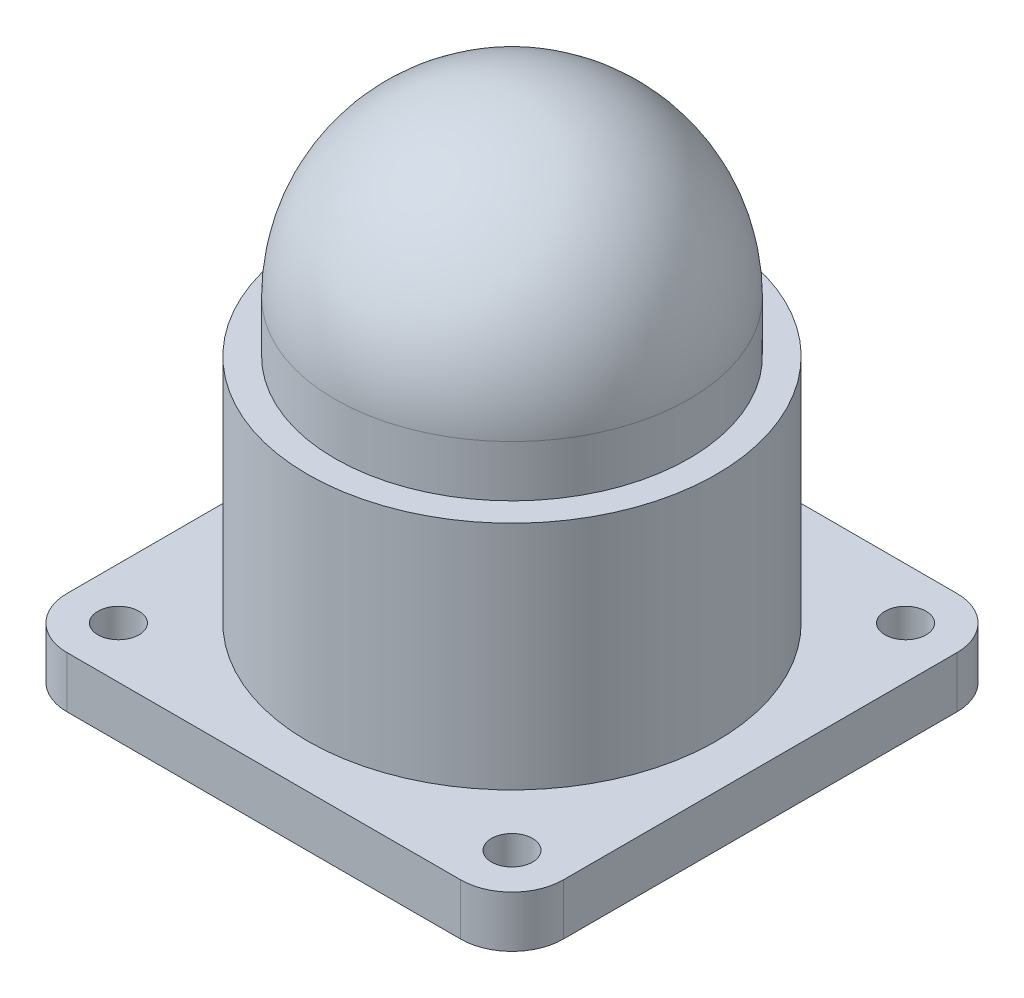
ISO-10303-21;
HEADER;
FILE_DESCRIPTION(('STEP AP214'),'2;1');
FILE_NAME('part.step','',(''),(''),'','','');
FILE_SCHEMA(('AUTOMOTIVE_DESIGN { 1 0 10303 214 1 1 1 1 }'));
ENDSEC;
DATA;
#1=APPLICATION_CONTEXT('core data for automotive mechanical design processes');
#2=APPLICATION_PROTOCOL_DEFINITION('international standard','automotive_design',2000,#1);
#3=PRODUCT_CONTEXT('',#1,'mechanical');
#4=PRODUCT('Part','Part','',(#3));
#5=PRODUCT_RELATED_PRODUCT_CATEGORY('part','',(#4));
#6=PRODUCT_DEFINITION_FORMATION('','',#4);
#7=PRODUCT_DEFINITION_CONTEXT('part definition',#1,'design');
#8=PRODUCT_DEFINITION('design','',#6,#7);
#9=PRODUCT_DEFINITION_SHAPE('','',#8);
#10=(LENGTH_UNIT() NAMED_UNIT(*) SI_UNIT(.MILLI.,.METRE.));
#11=(NAMED_UNIT(*) PLANE_ANGLE_UNIT() SI_UNIT($,.RADIAN.));
#12=(NAMED_UNIT(*) SI_UNIT($,.STERADIAN.) SOLID_ANGLE_UNIT());
#13=UNCERTAINTY_MEASURE_WITH_UNIT(LENGTH_MEASURE(1.E-05),#10,'distance_accuracy_value','');
#14=(GEOMETRIC_REPRESENTATION_CONTEXT(3) GLOBAL_UNCERTAINTY_ASSIGNED_CONTEXT((#13)) GLOBAL_UNIT_ASSIGNED_CONTEXT((#10,
#11,#12)) REPRESENTATION_CONTEXT('',''));
#15=CARTESIAN_POINT('',(0.,0.,0.));
#16=DIRECTION('',(0.,0.,1.));
#17=DIRECTION('',(1.,0.,0.));
#18=AXIS2_PLACEMENT_3D('',#15,#16,#17);
#19=CARTESIAN_POINT('',(0.,3.,0.));
#20=DIRECTION('',(0.,-1.,0.));
#21=DIRECTION('',(0.,0.,-1.));
#22=AXIS2_PLACEMENT_3D('',#19,#20,#21);
#23=PLANE('',#22);
#24=CARTESIAN_POINT('',(14.5,3.,-14.5));
#25=DIRECTION('',(0.,1.,0.));
#26=DIRECTION('',(0.,0.,1.));
#27=AXIS2_PLACEMENT_3D('',#24,#25,#26);
#28=CIRCLE('',#27,11.95);
#29=CARTESIAN_POINT('',(14.5,3.,-2.55000000000001));
#30=VERTEX_POINT('',#29);
#31=EDGE_CURVE('E44',#30,#30,#28,.T.);
#32=ORIENTED_EDGE('',*,*,#31,.F.);
#33=EDGE_LOOP('',(#32));
#34=FACE_BOUND('',#33,.T.);
#35=DIRECTION('',(-1.,0.,0.));
#36=VECTOR('',#35,1.);
#37=CARTESIAN_POINT('',(0.,3.,-29.));
#38=LINE('',#37,#36);
#39=CARTESIAN_POINT('',(26.,3.,-29.));
#40=VERTEX_POINT('',#39);
#41=CARTESIAN_POINT('',(3.,3.,-29.));
#42=VERTEX_POINT('',#41);
#43=EDGE_CURVE('E141',#40,#42,#38,.T.);
#44=ORIENTED_EDGE('',*,*,#43,.T.);
#45=CARTESIAN_POINT('',(3.,3.,-26.));
#46=DIRECTION('',(0.,-1.,0.));
#47=DIRECTION('',(0.,0.,-1.));
#48=AXIS2_PLACEMENT_3D('',#45,#46,#47);
#49=CIRCLE('',#48,3.);
#50=CARTESIAN_POINT('',(0.,3.,-26.));
#51=VERTEX_POINT('',#50);
#52=EDGE_CURVE('E160',#42,#51,#49,.F.);
#53=ORIENTED_EDGE('',*,*,#52,.T.);
#54=DIRECTION('',(0.,0.,1.));
#55=VECTOR('',#54,1.);
#56=CARTESIAN_POINT('',(0.,3.,0.));
#57=LINE('',#56,#55);
#58=CARTESIAN_POINT('',(0.,3.,-3.));
#59=VERTEX_POINT('',#58);
#60=EDGE_CURVE('E124',#51,#59,#57,.T.);
#61=ORIENTED_EDGE('',*,*,#60,.T.);
#62=CARTESIAN_POINT('',(3.,3.,-3.));
#63=DIRECTION('',(0.,-1.,0.));
#64=DIRECTION('',(0.,0.,-1.));
#65=AXIS2_PLACEMENT_3D('',#62,#63,#64);
#66=CIRCLE('',#65,3.);
#67=CARTESIAN_POINT('',(3.,3.,0.));
#68=VERTEX_POINT('',#67);
#69=EDGE_CURVE('E155',#59,#68,#66,.F.);
#70=ORIENTED_EDGE('',*,*,#69,.T.);
#71=DIRECTION('',(1.,0.,0.));
#72=VECTOR('',#71,1.);
#73=CARTESIAN_POINT('',(0.,3.,0.));
#74=LINE('',#73,#72);
#75=CARTESIAN_POINT('',(26.,3.,0.));
#76=VERTEX_POINT('',#75);
#77=EDGE_CURVE('E199',#68,#76,#74,.T.);
#78=ORIENTED_EDGE('',*,*,#77,.T.);
#79=CARTESIAN_POINT('',(26.,3.,-3.));
#80=DIRECTION('',(0.,-1.,0.));
#81=DIRECTION('',(0.,0.,-1.));
#82=AXIS2_PLACEMENT_3D('',#79,#80,#81);
#83=CIRCLE('',#82,3.);
#84=CARTESIAN_POINT('',(29.,3.,-3.));
#85=VERTEX_POINT('',#84);
#86=EDGE_CURVE('E59',#76,#85,#83,.F.);
#87=ORIENTED_EDGE('',*,*,#86,.T.);
#88=DIRECTION('',(0.,0.,-1.));
#89=VECTOR('',#88,1.);
#90=CARTESIAN_POINT('',(29.,3.,0.));
#91=LINE('',#90,#89);
#92=CARTESIAN_POINT('',(29.,3.,-26.));
#93=VERTEX_POINT('',#92);
#94=EDGE_CURVE('E200',#85,#93,#91,.T.);
#95=ORIENTED_EDGE('',*,*,#94,.T.);
#96=CARTESIAN_POINT('',(26.,3.,-26.));
#97=DIRECTION('',(0.,-1.,0.));
#98=DIRECTION('',(0.,0.,-1.));
#99=AXIS2_PLACEMENT_3D('',#96,#97,#98);
#100=CIRCLE('',#99,3.);
#101=EDGE_CURVE('E158',#93,#40,#100,.F.);
#102=ORIENTED_EDGE('',*,*,#101,.T.);
#103=EDGE_LOOP('',(#44,#53,#61,#70,#78,#87,#95,#102));
#104=FACE_BOUND('',#103,.T.);
#105=CARTESIAN_POINT('',(3.,3.,-26.));
#106=DIRECTION('',(0.,1.,0.));
#107=DIRECTION('',(0.,0.,1.));
#108=AXIS2_PLACEMENT_3D('',#105,#106,#107);
#109=CIRCLE('',#108,1.2);
#110=CARTESIAN_POINT('',(3.,3.,-24.8));
#111=VERTEX_POINT('',#110);
#112=EDGE_CURVE('E132',#111,#111,#109,.T.);
#113=ORIENTED_EDGE('',*,*,#112,.F.);
#114=EDGE_LOOP('',(#113));
#115=FACE_BOUND('',#114,.T.);
#116=CARTESIAN_POINT('',(26.,3.,-26.));
#117=DIRECTION('',(0.,1.,0.));
#118=DIRECTION('',(0.,0.,-1.));
#119=AXIS2_PLACEMENT_3D('',#116,#117,#118);
#120=CIRCLE('',#119,1.2);
#121=CARTESIAN_POINT('',(26.,3.,-27.2));
#122=VERTEX_POINT('',#121);
#123=EDGE_CURVE('E191',#122,#122,#120,.T.);
#124=ORIENTED_EDGE('',*,*,#123,.F.);
#125=EDGE_LOOP('',(#124));
#126=FACE_BOUND('',#125,.T.);
#127=CARTESIAN_POINT('',(26.,3.,-3.));
#128=DIRECTION('',(0.,1.,0.));
#129=DIRECTION('',(0.,0.,1.));
#130=AXIS2_PLACEMENT_3D('',#127,#128,#129);
#131=CIRCLE('',#130,1.2);
#132=CARTESIAN_POINT('',(26.,3.,-1.8));
#133=VERTEX_POINT('',#132);
#134=EDGE_CURVE('E185',#133,#133,#131,.T.);
#135=ORIENTED_EDGE('',*,*,#134,.F.);
#136=EDGE_LOOP('',(#135));
#137=FACE_BOUND('',#136,.T.);
#138=CARTESIAN_POINT('',(3.,3.,-3.));
#139=DIRECTION('',(0.,1.,0.));
#140=DIRECTION('',(0.,0.,-1.));
#141=AXIS2_PLACEMENT_3D('',#138,#139,#140);
#142=CIRCLE('',#141,1.2);
#143=CARTESIAN_POINT('',(3.,3.,-4.2));
#144=VERTEX_POINT('',#143);
#145=EDGE_CURVE('E178',#144,#144,#142,.T.);
#146=ORIENTED_EDGE('',*,*,#145,.F.);
#147=EDGE_LOOP('',(#146));
#148=FACE_BOUND('',#147,.T.);
#149=ADVANCED_FACE('F35',(#34,#104,#115,#126,#137,#148),#23,.F.);
#150=CARTESIAN_POINT('',(0.,0.,0.));
#151=DIRECTION('',(0.,-1.,0.));
#152=DIRECTION('',(0.,0.,-1.));
#153=AXIS2_PLACEMENT_3D('',#150,#151,#152);
#154=PLANE('',#153);
#155=CARTESIAN_POINT('',(26.,0.,-3.));
#156=DIRECTION('',(0.,1.,0.));
#157=DIRECTION('',(0.,0.,1.));
#158=AXIS2_PLACEMENT_3D('',#155,#156,#157);
#159=CIRCLE('',#158,1.2);
#160=CARTESIAN_POINT('',(26.,0.,-1.8));
#161=VERTEX_POINT('',#160);
#162=EDGE_CURVE('E181',#161,#161,#159,.T.);
#163=ORIENTED_EDGE('',*,*,#162,.T.);
#164=EDGE_LOOP('',(#163));
#165=FACE_BOUND('',#164,.T.);
#166=CARTESIAN_POINT('',(3.,0.,-26.));
#167=DIRECTION('',(0.,1.,0.));
#168=DIRECTION('',(0.,0.,1.));
#169=AXIS2_PLACEMENT_3D('',#166,#167,#168);
#170=CIRCLE('',#169,1.2);
#171=CARTESIAN_POINT('',(3.,0.,-24.8));
#172=VERTEX_POINT('',#171);
#173=EDGE_CURVE('E138',#172,#172,#170,.T.);
#174=ORIENTED_EDGE('',*,*,#173,.T.);
#175=EDGE_LOOP('',(#174));
#176=FACE_BOUND('',#175,.T.);
#177=DIRECTION('',(0.,0.,1.));
#178=VECTOR('',#177,1.);
#179=CARTESIAN_POINT('',(0.,0.,0.));
#180=LINE('',#179,#178);
#181=CARTESIAN_POINT('',(0.,0.,-26.));
#182=VERTEX_POINT('',#181);
#183=CARTESIAN_POINT('',(0.,0.,-3.));
#184=VERTEX_POINT('',#183);
#185=EDGE_CURVE('E121',#182,#184,#180,.T.);
#186=ORIENTED_EDGE('',*,*,#185,.F.);
#187=CARTESIAN_POINT('',(3.,0.,-26.));
#188=DIRECTION('',(0.,-1.,0.));
#189=DIRECTION('',(0.,0.,-1.));
#190=AXIS2_PLACEMENT_3D('',#187,#188,#189);
#191=CIRCLE('',#190,3.);
#192=CARTESIAN_POINT('',(3.,0.,-29.));
#193=VERTEX_POINT('',#192);
#194=EDGE_CURVE('E104',#182,#193,#191,.T.);
#195=ORIENTED_EDGE('',*,*,#194,.T.);
#196=DIRECTION('',(-1.,0.,0.));
#197=VECTOR('',#196,1.);
#198=CARTESIAN_POINT('',(0.,0.,-29.));
#199=LINE('',#198,#197);
#200=CARTESIAN_POINT('',(26.,0.,-29.));
#201=VERTEX_POINT('',#200);
#202=EDGE_CURVE('E145',#201,#193,#199,.T.);
#203=ORIENTED_EDGE('',*,*,#202,.F.);
#204=CARTESIAN_POINT('',(26.,0.,-26.));
#205=DIRECTION('',(0.,-1.,0.));
#206=DIRECTION('',(0.,0.,-1.));
#207=AXIS2_PLACEMENT_3D('',#204,#205,#206);
#208=CIRCLE('',#207,3.);
#209=CARTESIAN_POINT('',(29.,0.,-26.));
#210=VERTEX_POINT('',#209);
#211=EDGE_CURVE('E115',#201,#210,#208,.T.);
#212=ORIENTED_EDGE('',*,*,#211,.T.);
#213=DIRECTION('',(0.,0.,-1.));
#214=VECTOR('',#213,1.);
#215=CARTESIAN_POINT('',(29.,0.,0.));
#216=LINE('',#215,#214);
#217=CARTESIAN_POINT('',(29.,0.,-3.));
#218=VERTEX_POINT('',#217);
#219=EDGE_CURVE('E135',#218,#210,#216,.T.);
#220=ORIENTED_EDGE('',*,*,#219,.F.);
#221=CARTESIAN_POINT('',(26.,0.,-3.));
#222=DIRECTION('',(0.,-1.,0.));
#223=DIRECTION('',(0.,0.,-1.));
#224=AXIS2_PLACEMENT_3D('',#221,#222,#223);
#225=CIRCLE('',#224,3.);
#226=CARTESIAN_POINT('',(26.,0.,0.));
#227=VERTEX_POINT('',#226);
#228=EDGE_CURVE('E149',#218,#227,#225,.T.);
#229=ORIENTED_EDGE('',*,*,#228,.T.);
#230=DIRECTION('',(1.,0.,0.));
#231=VECTOR('',#230,1.);
#232=CARTESIAN_POINT('',(0.,0.,0.));
#233=LINE('',#232,#231);
#234=CARTESIAN_POINT('',(3.,0.,0.));
#235=VERTEX_POINT('',#234);
#236=EDGE_CURVE('E131',#235,#227,#233,.T.);
#237=ORIENTED_EDGE('',*,*,#236,.F.);
#238=CARTESIAN_POINT('',(3.,0.,-3.));
#239=DIRECTION('',(0.,-1.,0.));
#240=DIRECTION('',(0.,0.,-1.));
#241=AXIS2_PLACEMENT_3D('',#238,#239,#240);
#242=CIRCLE('',#241,3.);
#243=EDGE_CURVE('E125',#235,#184,#242,.T.);
#244=ORIENTED_EDGE('',*,*,#243,.T.);
#245=EDGE_LOOP('',(#186,#195,#203,#212,#220,#229,#237,#244));
#246=FACE_BOUND('',#245,.T.);
#247=CARTESIAN_POINT('',(26.,0.,-26.));
#248=DIRECTION('',(0.,1.,0.));
#249=DIRECTION('',(0.,0.,-1.));
#250=AXIS2_PLACEMENT_3D('',#247,#248,#249);
#251=CIRCLE('',#250,1.2);
#252=CARTESIAN_POINT('',(26.,0.,-27.2));
#253=VERTEX_POINT('',#252);
#254=EDGE_CURVE('E188',#253,#253,#251,.T.);
#255=ORIENTED_EDGE('',*,*,#254,.T.);
#256=EDGE_LOOP('',(#255));
#257=FACE_BOUND('',#256,.T.);
#258=CARTESIAN_POINT('',(3.,0.,-3.));
#259=DIRECTION('',(0.,1.,0.));
#260=DIRECTION('',(0.,0.,-1.));
#261=AXIS2_PLACEMENT_3D('',#258,#259,#260);
#262=CIRCLE('',#261,1.2);
#263=CARTESIAN_POINT('',(3.,0.,-4.2));
#264=VERTEX_POINT('',#263);
#265=EDGE_CURVE('E182',#264,#264,#262,.T.);
#266=ORIENTED_EDGE('',*,*,#265,.T.);
#267=EDGE_LOOP('',(#266));
#268=FACE_BOUND('',#267,.T.);
#269=ADVANCED_FACE('F128',(#165,#176,#246,#257,#268),#154,.T.);
#270=CARTESIAN_POINT('',(0.,3.,0.));
#271=DIRECTION('',(1.,0.,0.));
#272=DIRECTION('',(0.,0.,-1.));
#273=AXIS2_PLACEMENT_3D('',#270,#271,#272);
#274=PLANE('',#273);
#275=ORIENTED_EDGE('',*,*,#60,.F.);
#276=DIRECTION('',(0.,-1.,0.));
#277=VECTOR('',#276,1.);
#278=CARTESIAN_POINT('',(0.,3.,-26.));
#279=LINE('',#278,#277);
#280=EDGE_CURVE('E108',#51,#182,#279,.T.);
#281=ORIENTED_EDGE('',*,*,#280,.T.);
#282=ORIENTED_EDGE('',*,*,#185,.T.);
#283=DIRECTION('',(0.,-1.,0.));
#284=VECTOR('',#283,1.);
#285=CARTESIAN_POINT('',(0.,3.,-3.));
#286=LINE('',#285,#284);
#287=EDGE_CURVE('E126',#184,#59,#286,.F.);
#288=ORIENTED_EDGE('',*,*,#287,.T.);
#289=EDGE_LOOP('',(#275,#281,#282,#288));
#290=FACE_BOUND('',#289,.T.);
#291=ADVANCED_FACE('F120',(#290),#274,.F.);
#292=CARTESIAN_POINT('',(0.,3.,0.));
#293=DIRECTION('',(0.,0.,-1.));
#294=DIRECTION('',(-1.,0.,0.));
#295=AXIS2_PLACEMENT_3D('',#292,#293,#294);
#296=PLANE('',#295);
#297=ORIENTED_EDGE('',*,*,#236,.T.);
#298=DIRECTION('',(0.,-1.,0.));
#299=VECTOR('',#298,1.);
#300=CARTESIAN_POINT('',(26.,3.,0.));
#301=LINE('',#300,#299);
#302=EDGE_CURVE('E39',#227,#76,#301,.F.);
#303=ORIENTED_EDGE('',*,*,#302,.T.);
#304=ORIENTED_EDGE('',*,*,#77,.F.);
#305=DIRECTION('',(0.,-1.,0.));
#306=VECTOR('',#305,1.);
#307=CARTESIAN_POINT('',(3.,3.,0.));
#308=LINE('',#307,#306);
#309=EDGE_CURVE('E165',#68,#235,#308,.T.);
#310=ORIENTED_EDGE('',*,*,#309,.T.);
#311=EDGE_LOOP('',(#297,#303,#304,#310));
#312=FACE_BOUND('',#311,.T.);
#313=ADVANCED_FACE('F215',(#312),#296,.F.);
#314=CARTESIAN_POINT('',(29.,3.,0.));
#315=DIRECTION('',(-1.,0.,0.));
#316=DIRECTION('',(0.,0.,1.));
#317=AXIS2_PLACEMENT_3D('',#314,#315,#316);
#318=PLANE('',#317);
#319=ORIENTED_EDGE('',*,*,#219,.T.);
#320=DIRECTION('',(0.,-1.,0.));
#321=VECTOR('',#320,1.);
#322=CARTESIAN_POINT('',(29.,3.,-26.));
#323=LINE('',#322,#321);
#324=EDGE_CURVE('E52',#210,#93,#323,.F.);
#325=ORIENTED_EDGE('',*,*,#324,.T.);
#326=ORIENTED_EDGE('',*,*,#94,.F.);
#327=DIRECTION('',(0.,-1.,0.));
#328=VECTOR('',#327,1.);
#329=CARTESIAN_POINT('',(29.,3.,-3.));
#330=LINE('',#329,#328);
#331=EDGE_CURVE('E162',#85,#218,#330,.T.);
#332=ORIENTED_EDGE('',*,*,#331,.T.);
#333=EDGE_LOOP('',(#319,#325,#326,#332));
#334=FACE_BOUND('',#333,.T.);
#335=ADVANCED_FACE('F211',(#334),#318,.F.);
#336=CARTESIAN_POINT('',(0.,3.,-29.));
#337=DIRECTION('',(0.,0.,1.));
#338=DIRECTION('',(1.,0.,0.));
#339=AXIS2_PLACEMENT_3D('',#336,#337,#338);
#340=PLANE('',#339);
#341=ORIENTED_EDGE('',*,*,#202,.T.);
#342=DIRECTION('',(0.,-1.,0.));
#343=VECTOR('',#342,1.);
#344=CARTESIAN_POINT('',(3.,3.,-29.));
#345=LINE('',#344,#343);
#346=EDGE_CURVE('E109',#193,#42,#345,.F.);
#347=ORIENTED_EDGE('',*,*,#346,.T.);
#348=ORIENTED_EDGE('',*,*,#43,.F.);
#349=DIRECTION('',(0.,-1.,0.));
#350=VECTOR('',#349,1.);
#351=CARTESIAN_POINT('',(26.,3.,-29.));
#352=LINE('',#351,#350);
#353=EDGE_CURVE('E114',#40,#201,#352,.T.);
#354=ORIENTED_EDGE('',*,*,#353,.T.);
#355=EDGE_LOOP('',(#341,#347,#348,#354));
#356=FACE_BOUND('',#355,.T.);
#357=ADVANCED_FACE('F207',(#356),#340,.F.);
#358=CARTESIAN_POINT('',(3.,3.,-26.));
#359=DIRECTION('',(0.,-1.,0.));
#360=DIRECTION('',(0.,0.,-1.));
#361=AXIS2_PLACEMENT_3D('',#358,#359,#360);
#362=CYLINDRICAL_SURFACE('',#361,1.2);
#363=ORIENTED_EDGE('',*,*,#112,.T.);
#364=EDGE_LOOP('',(#363));
#365=FACE_BOUND('',#364,.T.);
#366=ORIENTED_EDGE('',*,*,#173,.F.);
#367=EDGE_LOOP('',(#366));
#368=FACE_BOUND('',#367,.T.);
#369=ADVANCED_FACE('F235',(#365,#368),#362,.F.);
#370=CARTESIAN_POINT('',(26.,3.,-26.));
#371=DIRECTION('',(0.,-1.,0.));
#372=DIRECTION('',(0.,0.,-1.));
#373=AXIS2_PLACEMENT_3D('',#370,#371,#372);
#374=CYLINDRICAL_SURFACE('',#373,1.2);
#375=ORIENTED_EDGE('',*,*,#123,.T.);
#376=EDGE_LOOP('',(#375));
#377=FACE_BOUND('',#376,.T.);
#378=ORIENTED_EDGE('',*,*,#254,.F.);
#379=EDGE_LOOP('',(#378));
#380=FACE_BOUND('',#379,.T.);
#381=ADVANCED_FACE('F242',(#377,#380),#374,.F.);
#382=CARTESIAN_POINT('',(26.,3.,-3.));
#383=DIRECTION('',(0.,-1.,0.));
#384=DIRECTION('',(0.,0.,-1.));
#385=AXIS2_PLACEMENT_3D('',#382,#383,#384);
#386=CYLINDRICAL_SURFACE('',#385,1.2);
#387=ORIENTED_EDGE('',*,*,#134,.T.);
#388=EDGE_LOOP('',(#387));
#389=FACE_BOUND('',#388,.T.);
#390=ORIENTED_EDGE('',*,*,#162,.F.);
#391=EDGE_LOOP('',(#390));
#392=FACE_BOUND('',#391,.T.);
#393=ADVANCED_FACE('F247',(#389,#392),#386,.F.);
#394=CARTESIAN_POINT('',(3.,3.,-3.));
#395=DIRECTION('',(0.,-1.,0.));
#396=DIRECTION('',(0.,0.,-1.));
#397=AXIS2_PLACEMENT_3D('',#394,#395,#396);
#398=CYLINDRICAL_SURFACE('',#397,1.2);
#399=ORIENTED_EDGE('',*,*,#145,.T.);
#400=EDGE_LOOP('',(#399));
#401=FACE_BOUND('',#400,.T.);
#402=ORIENTED_EDGE('',*,*,#265,.F.);
#403=EDGE_LOOP('',(#402));
#404=FACE_BOUND('',#403,.T.);
#405=ADVANCED_FACE('F260',(#401,#404),#398,.F.);
#406=CARTESIAN_POINT('',(3.,3.,-26.));
#407=DIRECTION('',(0.,-1.,0.));
#408=DIRECTION('',(0.,0.,-1.));
#409=AXIS2_PLACEMENT_3D('',#406,#407,#408);
#410=CYLINDRICAL_SURFACE('',#409,3.);
#411=ORIENTED_EDGE('',*,*,#52,.F.);
#412=ORIENTED_EDGE('',*,*,#346,.F.);
#413=ORIENTED_EDGE('',*,*,#194,.F.);
#414=ORIENTED_EDGE('',*,*,#280,.F.);
#415=EDGE_LOOP('',(#411,#412,#413,#414));
#416=FACE_BOUND('',#415,.T.);
#417=ADVANCED_FACE('F107',(#416),#410,.T.);
#418=CARTESIAN_POINT('',(26.,3.,-26.));
#419=DIRECTION('',(0.,-1.,0.));
#420=DIRECTION('',(0.,0.,-1.));
#421=AXIS2_PLACEMENT_3D('',#418,#419,#420);
#422=CYLINDRICAL_SURFACE('',#421,3.);
#423=ORIENTED_EDGE('',*,*,#101,.F.);
#424=ORIENTED_EDGE('',*,*,#324,.F.);
#425=ORIENTED_EDGE('',*,*,#211,.F.);
#426=ORIENTED_EDGE('',*,*,#353,.F.);
#427=EDGE_LOOP('',(#423,#424,#425,#426));
#428=FACE_BOUND('',#427,.T.);
#429=ADVANCED_FACE('F209',(#428),#422,.T.);
#430=CARTESIAN_POINT('',(26.,3.,-3.));
#431=DIRECTION('',(0.,-1.,0.));
#432=DIRECTION('',(0.,0.,-1.));
#433=AXIS2_PLACEMENT_3D('',#430,#431,#432);
#434=CYLINDRICAL_SURFACE('',#433,3.);
#435=ORIENTED_EDGE('',*,*,#86,.F.);
#436=ORIENTED_EDGE('',*,*,#302,.F.);
#437=ORIENTED_EDGE('',*,*,#228,.F.);
#438=ORIENTED_EDGE('',*,*,#331,.F.);
#439=EDGE_LOOP('',(#435,#436,#437,#438));
#440=FACE_BOUND('',#439,.T.);
#441=ADVANCED_FACE('F214',(#440),#434,.T.);
#442=CARTESIAN_POINT('',(3.,3.,-3.));
#443=DIRECTION('',(0.,-1.,0.));
#444=DIRECTION('',(0.,0.,-1.));
#445=AXIS2_PLACEMENT_3D('',#442,#443,#444);
#446=CYLINDRICAL_SURFACE('',#445,3.);
#447=ORIENTED_EDGE('',*,*,#69,.F.);
#448=ORIENTED_EDGE('',*,*,#287,.F.);
#449=ORIENTED_EDGE('',*,*,#243,.F.);
#450=ORIENTED_EDGE('',*,*,#309,.F.);
#451=EDGE_LOOP('',(#447,#448,#449,#450));
#452=FACE_BOUND('',#451,.T.);
#453=ADVANCED_FACE('F37',(#452),#446,.T.);
#454=CARTESIAN_POINT('',(14.5,16.5,-14.5));
#455=DIRECTION('',(0.,-1.,0.));
#456=DIRECTION('',(0.,0.,-1.));
#457=AXIS2_PLACEMENT_3D('',#454,#455,#456);
#458=CYLINDRICAL_SURFACE('',#457,11.95);
#459=CARTESIAN_POINT('',(14.5,16.5,-14.5));
#460=DIRECTION('',(0.,1.,0.));
#461=DIRECTION('',(0.,0.,1.));
#462=AXIS2_PLACEMENT_3D('',#459,#460,#461);
#463=CIRCLE('',#462,11.95);
#464=CARTESIAN_POINT('',(14.5,16.5,-2.55000000000001));
#465=VERTEX_POINT('',#464);
#466=EDGE_CURVE('E177',#465,#465,#463,.T.);
#467=ORIENTED_EDGE('',*,*,#466,.F.);
#468=EDGE_LOOP('',(#467));
#469=FACE_BOUND('',#468,.T.);
#470=ORIENTED_EDGE('',*,*,#31,.T.);
#471=EDGE_LOOP('',(#470));
#472=FACE_BOUND('',#471,.T.);
#473=ADVANCED_FACE('F274',(#469,#472),#458,.T.);
#474=CARTESIAN_POINT('',(14.5,16.5,-14.5));
#475=DIRECTION('',(0.,1.,0.));
#476=DIRECTION('',(0.,0.,1.));
#477=AXIS2_PLACEMENT_3D('',#474,#475,#476);
#478=PLANE('',#477);
#479=CARTESIAN_POINT('',(14.5,16.5,-14.5));
#480=DIRECTION('',(0.,1.,0.));
#481=DIRECTION('',(0.,0.,1.));
#482=AXIS2_PLACEMENT_3D('',#479,#480,#481);
#483=CIRCLE('',#482,10.35);
#484=CARTESIAN_POINT('',(14.5,16.5,-4.15));
#485=VERTEX_POINT('',#484);
#486=EDGE_CURVE('E11',#485,#485,#483,.T.);
#487=ORIENTED_EDGE('',*,*,#486,.F.);
#488=EDGE_LOOP('',(#487));
#489=FACE_BOUND('',#488,.T.);
#490=ORIENTED_EDGE('',*,*,#466,.T.);
#491=EDGE_LOOP('',(#490));
#492=FACE_BOUND('',#491,.T.);
#493=ADVANCED_FACE('F277',(#489,#492),#478,.T.);
#494=CARTESIAN_POINT('',(14.5,19.5,-14.5));
#495=DIRECTION('',(0.,-1.,0.));
#496=DIRECTION('',(0.,0.,-1.));
#497=AXIS2_PLACEMENT_3D('',#494,#495,#496);
#498=CYLINDRICAL_SURFACE('',#497,10.35);
#499=CARTESIAN_POINT('',(14.5,19.5,-14.5));
#500=DIRECTION('',(0.,1.,0.));
#501=DIRECTION('',(0.,0.,1.));
#502=AXIS2_PLACEMENT_3D('',#499,#500,#501);
#503=CIRCLE('',#502,10.35);
#504=CARTESIAN_POINT('',(14.5,19.5,-4.15));
#505=VERTEX_POINT('',#504);
#506=EDGE_CURVE('E293',#505,#505,#503,.T.);
#507=ORIENTED_EDGE('',*,*,#506,.F.);
#508=EDGE_LOOP('',(#507));
#509=FACE_BOUND('',#508,.T.);
#510=ORIENTED_EDGE('',*,*,#486,.T.);
#511=EDGE_LOOP('',(#510));
#512=FACE_BOUND('',#511,.T.);
#513=ADVANCED_FACE('F281',(#509,#512),#498,.T.);
#514=CARTESIAN_POINT('',(14.5,19.5,-14.5));
#515=DIRECTION('',(0.,-1.,0.));
#516=DIRECTION('',(1.,0.,0.));
#517=AXIS2_PLACEMENT_3D('',#514,#515,#516);
#518=SPHERICAL_SURFACE('',#517,10.35);
#519=ORIENTED_EDGE('',*,*,#506,.T.);
#520=EDGE_LOOP('',(#519));
#521=FACE_BOUND('',#520,.T.);
#522=ADVANCED_FACE('F285',(#521),#518,.T.);
#523=CLOSED_SHELL('',(#149,#269,#291,#313,#335,#357,#369,#381,#393,#405,#417,#429,#441,#453,
#473,#493,#513,#522));
#524=MANIFOLD_SOLID_BREP('B2',#523);
#525=ADVANCED_BREP_SHAPE_REPRESENTATION('',(#18,#524),#14);
#526=SHAPE_DEFINITION_REPRESENTATION(#9,#525);
ENDSEC;
END-ISO-10303-21;
